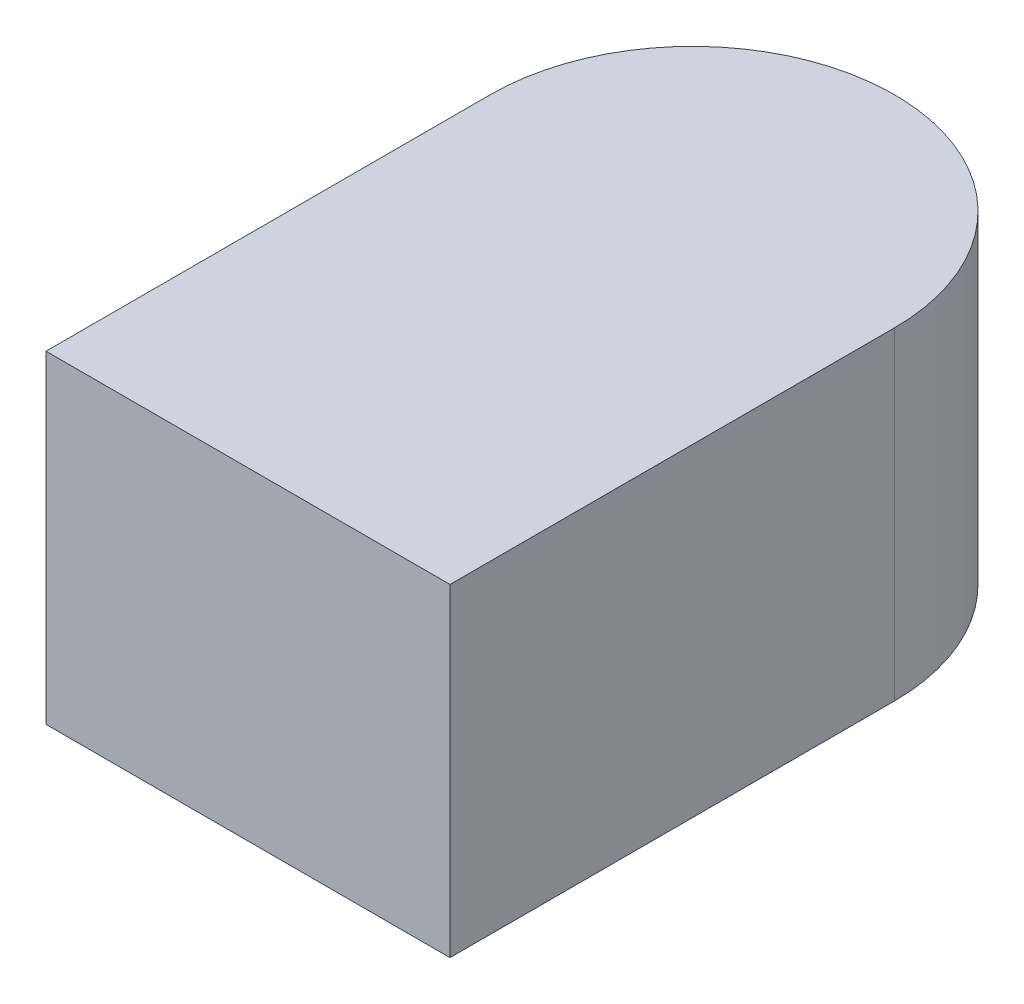
ISO-10303-21;
HEADER;
FILE_DESCRIPTION(('STEP AP214'),'2;1');
FILE_NAME('part.step','',(''),(''),'','','');
FILE_SCHEMA(('AUTOMOTIVE_DESIGN { 1 0 10303 214 1 1 1 1 }'));
ENDSEC;
DATA;
#1=APPLICATION_CONTEXT('core data for automotive mechanical design processes');
#2=APPLICATION_PROTOCOL_DEFINITION('international standard','automotive_design',2000,#1);
#3=PRODUCT_CONTEXT('',#1,'mechanical');
#4=PRODUCT('Part','Part','',(#3));
#5=PRODUCT_RELATED_PRODUCT_CATEGORY('part','',(#4));
#6=PRODUCT_DEFINITION_FORMATION('','',#4);
#7=PRODUCT_DEFINITION_CONTEXT('part definition',#1,'design');
#8=PRODUCT_DEFINITION('design','',#6,#7);
#9=PRODUCT_DEFINITION_SHAPE('','',#8);
#10=(LENGTH_UNIT() NAMED_UNIT(*) SI_UNIT(.MILLI.,.METRE.));
#11=(NAMED_UNIT(*) PLANE_ANGLE_UNIT() SI_UNIT($,.RADIAN.));
#12=(NAMED_UNIT(*) SI_UNIT($,.STERADIAN.) SOLID_ANGLE_UNIT());
#13=UNCERTAINTY_MEASURE_WITH_UNIT(LENGTH_MEASURE(1.E-05),#10,'distance_accuracy_value','');
#14=(GEOMETRIC_REPRESENTATION_CONTEXT(3) GLOBAL_UNCERTAINTY_ASSIGNED_CONTEXT((#13)) GLOBAL_UNIT_ASSIGNED_CONTEXT((#10,
#11,#12)) REPRESENTATION_CONTEXT('',''));
#15=CARTESIAN_POINT('',(0.,0.,0.));
#16=DIRECTION('',(0.,0.,1.));
#17=DIRECTION('',(1.,0.,0.));
#18=AXIS2_PLACEMENT_3D('',#15,#16,#17);
#19=CARTESIAN_POINT('',(0.,0.,0.));
#20=DIRECTION('',(0.,-1.,0.));
#21=DIRECTION('',(1.,0.,0.));
#22=AXIS2_PLACEMENT_3D('',#19,#20,#21);
#23=PLANE('',#22);
#24=CARTESIAN_POINT('',(0.75,0.,1.225));
#25=DIRECTION('',(0.,-1.,0.));
#26=DIRECTION('',(-1.,0.,0.));
#27=AXIS2_PLACEMENT_3D('',#24,#25,#26);
#28=CIRCLE('',#27,0.125);
#29=CARTESIAN_POINT('',(0.625,0.,1.225));
#30=VERTEX_POINT('',#29);
#31=CARTESIAN_POINT('',(0.875,0.,1.225));
#32=VERTEX_POINT('',#31);
#33=EDGE_CURVE('E11',#30,#32,#28,.T.);
#34=ORIENTED_EDGE('',*,*,#33,.T.);
#35=DIRECTION('',(0.,0.,1.));
#36=VECTOR('',#35,1.);
#37=CARTESIAN_POINT('',(0.875,0.,1.225));
#38=LINE('',#37,#36);
#39=CARTESIAN_POINT('',(0.875,0.,1.5));
#40=VERTEX_POINT('',#39);
#41=EDGE_CURVE('E24',#32,#40,#38,.T.);
#42=ORIENTED_EDGE('',*,*,#41,.T.);
#43=DIRECTION('',(-1.,0.,0.));
#44=VECTOR('',#43,1.);
#45=CARTESIAN_POINT('',(0.875,0.,1.5));
#46=LINE('',#45,#44);
#47=CARTESIAN_POINT('',(0.625,0.,1.5));
#48=VERTEX_POINT('',#47);
#49=EDGE_CURVE('E62',#40,#48,#46,.T.);
#50=ORIENTED_EDGE('',*,*,#49,.T.);
#51=DIRECTION('',(0.,0.,-1.));
#52=VECTOR('',#51,1.);
#53=CARTESIAN_POINT('',(0.625,0.,1.5));
#54=LINE('',#53,#52);
#55=EDGE_CURVE('E36',#48,#30,#54,.T.);
#56=ORIENTED_EDGE('',*,*,#55,.T.);
#57=EDGE_LOOP('',(#34,#42,#50,#56));
#58=FACE_BOUND('',#57,.T.);
#59=ADVANCED_FACE('F17',(#58),#23,.T.);
#60=CARTESIAN_POINT('',(0.625,0.,1.5));
#61=DIRECTION('',(1.,0.,0.));
#62=DIRECTION('',(0.,0.,-1.));
#63=AXIS2_PLACEMENT_3D('',#60,#61,#62);
#64=PLANE('',#63);
#65=DIRECTION('',(0.,1.,0.));
#66=VECTOR('',#65,1.);
#67=CARTESIAN_POINT('',(0.625,0.,1.5));
#68=LINE('',#67,#66);
#69=CARTESIAN_POINT('',(0.625,0.2,1.5));
#70=VERTEX_POINT('',#69);
#71=EDGE_CURVE('E84',#48,#70,#68,.T.);
#72=ORIENTED_EDGE('',*,*,#71,.T.);
#73=DIRECTION('',(0.,0.,-1.));
#74=VECTOR('',#73,1.);
#75=CARTESIAN_POINT('',(0.625,0.2,1.5));
#76=LINE('',#75,#74);
#77=CARTESIAN_POINT('',(0.625,0.2,1.225));
#78=VERTEX_POINT('',#77);
#79=EDGE_CURVE('E74',#70,#78,#76,.T.);
#80=ORIENTED_EDGE('',*,*,#79,.T.);
#81=DIRECTION('',(0.,1.,0.));
#82=VECTOR('',#81,1.);
#83=CARTESIAN_POINT('',(0.625,0.,1.225));
#84=LINE('',#83,#82);
#85=EDGE_CURVE('E81',#30,#78,#84,.T.);
#86=ORIENTED_EDGE('',*,*,#85,.F.);
#87=ORIENTED_EDGE('',*,*,#55,.F.);
#88=EDGE_LOOP('',(#72,#80,#86,#87));
#89=FACE_BOUND('',#88,.T.);
#90=ADVANCED_FACE('F91',(#89),#64,.F.);
#91=CARTESIAN_POINT('',(0.75,0.,1.225));
#92=DIRECTION('',(0.,-1.,0.));
#93=DIRECTION('',(1.,0.,0.));
#94=AXIS2_PLACEMENT_3D('',#91,#92,#93);
#95=CYLINDRICAL_SURFACE('',#94,0.125);
#96=ORIENTED_EDGE('',*,*,#85,.T.);
#97=CARTESIAN_POINT('',(0.75,0.2,1.225));
#98=DIRECTION('',(0.,-1.,0.));
#99=DIRECTION('',(-1.,0.,0.));
#100=AXIS2_PLACEMENT_3D('',#97,#98,#99);
#101=CIRCLE('',#100,0.125);
#102=CARTESIAN_POINT('',(0.875,0.2,1.225));
#103=VERTEX_POINT('',#102);
#104=EDGE_CURVE('E79',#78,#103,#101,.T.);
#105=ORIENTED_EDGE('',*,*,#104,.T.);
#106=DIRECTION('',(0.,1.,0.));
#107=VECTOR('',#106,1.);
#108=CARTESIAN_POINT('',(0.875,0.,1.225));
#109=LINE('',#108,#107);
#110=EDGE_CURVE('E68',#32,#103,#109,.T.);
#111=ORIENTED_EDGE('',*,*,#110,.F.);
#112=ORIENTED_EDGE('',*,*,#33,.F.);
#113=EDGE_LOOP('',(#96,#105,#111,#112));
#114=FACE_BOUND('',#113,.T.);
#115=ADVANCED_FACE('F89',(#114),#95,.T.);
#116=CARTESIAN_POINT('',(0.875,0.,1.225));
#117=DIRECTION('',(-1.,0.,0.));
#118=DIRECTION('',(0.,0.,1.));
#119=AXIS2_PLACEMENT_3D('',#116,#117,#118);
#120=PLANE('',#119);
#121=ORIENTED_EDGE('',*,*,#110,.T.);
#122=DIRECTION('',(0.,0.,1.));
#123=VECTOR('',#122,1.);
#124=CARTESIAN_POINT('',(0.875,0.2,1.225));
#125=LINE('',#124,#123);
#126=CARTESIAN_POINT('',(0.875,0.2,1.5));
#127=VERTEX_POINT('',#126);
#128=EDGE_CURVE('E63',#103,#127,#125,.T.);
#129=ORIENTED_EDGE('',*,*,#128,.T.);
#130=DIRECTION('',(0.,1.,0.));
#131=VECTOR('',#130,1.);
#132=CARTESIAN_POINT('',(0.875,0.,1.5));
#133=LINE('',#132,#131);
#134=EDGE_CURVE('E56',#40,#127,#133,.T.);
#135=ORIENTED_EDGE('',*,*,#134,.F.);
#136=ORIENTED_EDGE('',*,*,#41,.F.);
#137=EDGE_LOOP('',(#121,#129,#135,#136));
#138=FACE_BOUND('',#137,.T.);
#139=ADVANCED_FACE('F66',(#138),#120,.F.);
#140=CARTESIAN_POINT('',(0.875,0.,1.5));
#141=DIRECTION('',(0.,0.,-1.));
#142=DIRECTION('',(-1.,0.,0.));
#143=AXIS2_PLACEMENT_3D('',#140,#141,#142);
#144=PLANE('',#143);
#145=ORIENTED_EDGE('',*,*,#134,.T.);
#146=DIRECTION('',(-1.,0.,0.));
#147=VECTOR('',#146,1.);
#148=CARTESIAN_POINT('',(0.875,0.2,1.5));
#149=LINE('',#148,#147);
#150=EDGE_CURVE('E61',#127,#70,#149,.T.);
#151=ORIENTED_EDGE('',*,*,#150,.T.);
#152=ORIENTED_EDGE('',*,*,#71,.F.);
#153=ORIENTED_EDGE('',*,*,#49,.F.);
#154=EDGE_LOOP('',(#145,#151,#152,#153));
#155=FACE_BOUND('',#154,.T.);
#156=ADVANCED_FACE('F58',(#155),#144,.F.);
#157=CARTESIAN_POINT('',(0.,0.2,0.));
#158=DIRECTION('',(0.,-1.,0.));
#159=DIRECTION('',(1.,0.,0.));
#160=AXIS2_PLACEMENT_3D('',#157,#158,#159);
#161=PLANE('',#160);
#162=ORIENTED_EDGE('',*,*,#150,.F.);
#163=ORIENTED_EDGE('',*,*,#128,.F.);
#164=ORIENTED_EDGE('',*,*,#104,.F.);
#165=ORIENTED_EDGE('',*,*,#79,.F.);
#166=EDGE_LOOP('',(#162,#163,#164,#165));
#167=FACE_BOUND('',#166,.T.);
#168=ADVANCED_FACE('F72',(#167),#161,.F.);
#169=CLOSED_SHELL('',(#59,#90,#115,#139,#156,#168));
#170=MANIFOLD_SOLID_BREP('B1',#169);
#171=ADVANCED_BREP_SHAPE_REPRESENTATION('',(#18,#170),#14);
#172=SHAPE_DEFINITION_REPRESENTATION(#9,#171);
ENDSEC;
END-ISO-10303-21;
